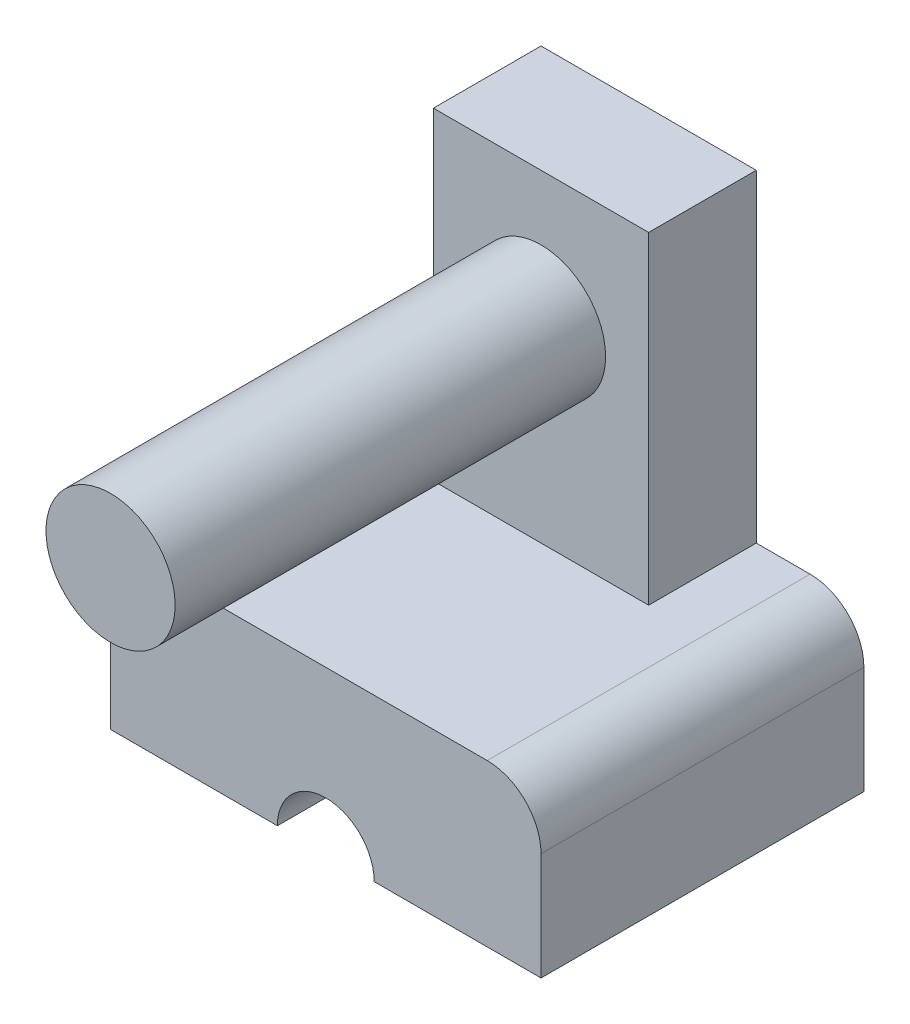
ISO-10303-21;
HEADER;
FILE_DESCRIPTION(('STEP AP214'),'2;1');
FILE_NAME('part.step','',(''),(''),'','','');
FILE_SCHEMA(('AUTOMOTIVE_DESIGN { 1 0 10303 214 1 1 1 1 }'));
ENDSEC;
DATA;
#1=APPLICATION_CONTEXT('core data for automotive mechanical design processes');
#2=APPLICATION_PROTOCOL_DEFINITION('international standard','automotive_design',2000,#1);
#3=PRODUCT_CONTEXT('',#1,'mechanical');
#4=PRODUCT('Part','Part','',(#3));
#5=PRODUCT_RELATED_PRODUCT_CATEGORY('part','',(#4));
#6=PRODUCT_DEFINITION_FORMATION('','',#4);
#7=PRODUCT_DEFINITION_CONTEXT('part definition',#1,'design');
#8=PRODUCT_DEFINITION('design','',#6,#7);
#9=PRODUCT_DEFINITION_SHAPE('','',#8);
#10=(LENGTH_UNIT() NAMED_UNIT(*) SI_UNIT(.MILLI.,.METRE.));
#11=(NAMED_UNIT(*) PLANE_ANGLE_UNIT() SI_UNIT($,.RADIAN.));
#12=(NAMED_UNIT(*) SI_UNIT($,.STERADIAN.) SOLID_ANGLE_UNIT());
#13=UNCERTAINTY_MEASURE_WITH_UNIT(LENGTH_MEASURE(1.E-05),#10,'distance_accuracy_value','');
#14=(GEOMETRIC_REPRESENTATION_CONTEXT(3) GLOBAL_UNCERTAINTY_ASSIGNED_CONTEXT((#13)) GLOBAL_UNIT_ASSIGNED_CONTEXT((#10,
#11,#12)) REPRESENTATION_CONTEXT('',''));
#15=CARTESIAN_POINT('',(0.,0.,0.));
#16=DIRECTION('',(0.,0.,1.));
#17=DIRECTION('',(1.,0.,0.));
#18=AXIS2_PLACEMENT_3D('',#15,#16,#17);
#19=CARTESIAN_POINT('',(0.,0.,0.));
#20=DIRECTION('',(0.,0.,1.));
#21=DIRECTION('',(1.,0.,0.));
#22=AXIS2_PLACEMENT_3D('',#19,#20,#21);
#23=PLANE('',#22);
#24=CARTESIAN_POINT('',(-25.,-5.,0.));
#25=DIRECTION('',(0.,0.,-1.));
#26=DIRECTION('',(-1.,0.,0.));
#27=AXIS2_PLACEMENT_3D('',#24,#25,#26);
#28=CIRCLE('',#27,5.);
#29=CARTESIAN_POINT('',(-30.,-5.00000000000003,0.));
#30=VERTEX_POINT('',#29);
#31=CARTESIAN_POINT('',(-25.,0.,0.));
#32=VERTEX_POINT('',#31);
#33=EDGE_CURVE('E123',#30,#32,#28,.T.);
#34=ORIENTED_EDGE('',*,*,#33,.T.);
#35=DIRECTION('',(1.,0.,0.));
#36=VECTOR('',#35,1.);
#37=CARTESIAN_POINT('',(10.,0.,0.));
#38=LINE('',#37,#36);
#39=CARTESIAN_POINT('',(-20.,0.,0.));
#40=VERTEX_POINT('',#39);
#41=EDGE_CURVE('E210',#32,#40,#38,.T.);
#42=ORIENTED_EDGE('',*,*,#41,.T.);
#43=DIRECTION('',(0.,-1.,0.));
#44=VECTOR('',#43,1.);
#45=CARTESIAN_POINT('',(-20.,0.,0.));
#46=LINE('',#45,#44);
#47=CARTESIAN_POINT('',(-20.,30.,0.));
#48=VERTEX_POINT('',#47);
#49=EDGE_CURVE('E169',#48,#40,#46,.T.);
#50=ORIENTED_EDGE('',*,*,#49,.F.);
#51=DIRECTION('',(-1.,0.,0.));
#52=VECTOR('',#51,1.);
#53=CARTESIAN_POINT('',(0.,30.,0.));
#54=LINE('',#53,#52);
#55=CARTESIAN_POINT('',(0.,30.,0.));
#56=VERTEX_POINT('',#55);
#57=EDGE_CURVE('E178',#56,#48,#54,.T.);
#58=ORIENTED_EDGE('',*,*,#57,.F.);
#59=DIRECTION('',(0.,1.,0.));
#60=VECTOR('',#59,1.);
#61=CARTESIAN_POINT('',(0.,0.,0.));
#62=LINE('',#61,#60);
#63=CARTESIAN_POINT('',(0.,0.,0.));
#64=VERTEX_POINT('',#63);
#65=EDGE_CURVE('E159',#64,#56,#62,.T.);
#66=ORIENTED_EDGE('',*,*,#65,.F.);
#67=CARTESIAN_POINT('',(4.99999999999996,0.,0.));
#68=VERTEX_POINT('',#67);
#69=EDGE_CURVE('E207',#64,#68,#38,.T.);
#70=ORIENTED_EDGE('',*,*,#69,.T.);
#71=CARTESIAN_POINT('',(5.,-5.,0.));
#72=DIRECTION('',(0.,0.,-1.));
#73=DIRECTION('',(-1.,0.,0.));
#74=AXIS2_PLACEMENT_3D('',#71,#72,#73);
#75=CIRCLE('',#74,5.);
#76=CARTESIAN_POINT('',(10.,-5.00000000000003,0.));
#77=VERTEX_POINT('',#76);
#78=EDGE_CURVE('E52',#77,#68,#75,.F.);
#79=ORIENTED_EDGE('',*,*,#78,.F.);
#80=DIRECTION('',(0.,1.,0.));
#81=VECTOR('',#80,1.);
#82=CARTESIAN_POINT('',(10.,-15.,0.));
#83=LINE('',#82,#81);
#84=CARTESIAN_POINT('',(10.,-15.,0.));
#85=VERTEX_POINT('',#84);
#86=EDGE_CURVE('E146',#85,#77,#83,.T.);
#87=ORIENTED_EDGE('',*,*,#86,.F.);
#88=DIRECTION('',(1.,0.,0.));
#89=VECTOR('',#88,1.);
#90=CARTESIAN_POINT('',(10.,-15.,0.));
#91=LINE('',#90,#89);
#92=CARTESIAN_POINT('',(-5.5,-15.,0.));
#93=VERTEX_POINT('',#92);
#94=EDGE_CURVE('E228',#93,#85,#91,.T.);
#95=ORIENTED_EDGE('',*,*,#94,.F.);
#96=CARTESIAN_POINT('',(-10.,-15.,0.));
#97=DIRECTION('',(0.,0.,-1.));
#98=DIRECTION('',(-1.,0.,0.));
#99=AXIS2_PLACEMENT_3D('',#96,#97,#98);
#100=CIRCLE('',#99,4.5);
#101=CARTESIAN_POINT('',(-14.5,-15.,0.));
#102=VERTEX_POINT('',#101);
#103=EDGE_CURVE('E212',#102,#93,#100,.T.);
#104=ORIENTED_EDGE('',*,*,#103,.F.);
#105=CARTESIAN_POINT('',(-30.,-15.,0.));
#106=VERTEX_POINT('',#105);
#107=EDGE_CURVE('E145',#106,#102,#91,.T.);
#108=ORIENTED_EDGE('',*,*,#107,.F.);
#109=DIRECTION('',(0.,1.,0.));
#110=VECTOR('',#109,1.);
#111=CARTESIAN_POINT('',(-30.,-15.,0.));
#112=LINE('',#111,#110);
#113=EDGE_CURVE('E137',#106,#30,#112,.T.);
#114=ORIENTED_EDGE('',*,*,#113,.T.);
#115=EDGE_LOOP('',(#34,#42,#50,#58,#66,#70,#79,#87,#95,#104,#108,#114));
#116=FACE_BOUND('',#115,.T.);
#117=ADVANCED_FACE('F37',(#116),#23,.F.);
#118=CARTESIAN_POINT('',(10.,-15.,30.));
#119=DIRECTION('',(0.,0.,-1.));
#120=DIRECTION('',(-1.,0.,0.));
#121=AXIS2_PLACEMENT_3D('',#118,#119,#120);
#122=PLANE('',#121);
#123=CARTESIAN_POINT('',(-25.,-5.,30.));
#124=DIRECTION('',(0.,0.,-1.));
#125=DIRECTION('',(-1.,0.,0.));
#126=AXIS2_PLACEMENT_3D('',#123,#124,#125);
#127=CIRCLE('',#126,5.);
#128=CARTESIAN_POINT('',(-30.,-5.00000000000003,30.));
#129=VERTEX_POINT('',#128);
#130=CARTESIAN_POINT('',(-25.,0.,30.));
#131=VERTEX_POINT('',#130);
#132=EDGE_CURVE('E59',#129,#131,#127,.T.);
#133=ORIENTED_EDGE('',*,*,#132,.F.);
#134=DIRECTION('',(0.,1.,0.));
#135=VECTOR('',#134,1.);
#136=CARTESIAN_POINT('',(-30.,-15.,30.));
#137=LINE('',#136,#135);
#138=CARTESIAN_POINT('',(-30.,-15.,30.));
#139=VERTEX_POINT('',#138);
#140=EDGE_CURVE('E140',#139,#129,#137,.T.);
#141=ORIENTED_EDGE('',*,*,#140,.F.);
#142=DIRECTION('',(-1.,0.,0.));
#143=VECTOR('',#142,1.);
#144=CARTESIAN_POINT('',(10.,-15.,30.));
#145=LINE('',#144,#143);
#146=CARTESIAN_POINT('',(-14.5,-15.,30.));
#147=VERTEX_POINT('',#146);
#148=EDGE_CURVE('E219',#147,#139,#145,.T.);
#149=ORIENTED_EDGE('',*,*,#148,.F.);
#150=CARTESIAN_POINT('',(-10.,-15.,30.));
#151=DIRECTION('',(0.,0.,-1.));
#152=DIRECTION('',(-1.,0.,0.));
#153=AXIS2_PLACEMENT_3D('',#150,#151,#152);
#154=CIRCLE('',#153,4.5);
#155=CARTESIAN_POINT('',(-5.5,-15.,30.));
#156=VERTEX_POINT('',#155);
#157=EDGE_CURVE('E208',#147,#156,#154,.T.);
#158=ORIENTED_EDGE('',*,*,#157,.T.);
#159=CARTESIAN_POINT('',(10.,-15.,30.));
#160=VERTEX_POINT('',#159);
#161=EDGE_CURVE('E224',#160,#156,#145,.T.);
#162=ORIENTED_EDGE('',*,*,#161,.F.);
#163=DIRECTION('',(0.,1.,0.));
#164=VECTOR('',#163,1.);
#165=CARTESIAN_POINT('',(10.,-15.,30.));
#166=LINE('',#165,#164);
#167=CARTESIAN_POINT('',(10.,-5.00000000000003,30.));
#168=VERTEX_POINT('',#167);
#169=EDGE_CURVE('E148',#160,#168,#166,.T.);
#170=ORIENTED_EDGE('',*,*,#169,.T.);
#171=CARTESIAN_POINT('',(5.,-5.,30.));
#172=DIRECTION('',(0.,0.,-1.));
#173=DIRECTION('',(-1.,0.,0.));
#174=AXIS2_PLACEMENT_3D('',#171,#172,#173);
#175=CIRCLE('',#174,5.);
#176=CARTESIAN_POINT('',(4.99999999999996,0.,30.));
#177=VERTEX_POINT('',#176);
#178=EDGE_CURVE('E141',#168,#177,#175,.F.);
#179=ORIENTED_EDGE('',*,*,#178,.T.);
#180=DIRECTION('',(-1.,0.,0.));
#181=VECTOR('',#180,1.);
#182=CARTESIAN_POINT('',(10.,0.,30.));
#183=LINE('',#182,#181);
#184=EDGE_CURVE('E203',#177,#131,#183,.T.);
#185=ORIENTED_EDGE('',*,*,#184,.T.);
#186=EDGE_LOOP('',(#133,#141,#149,#158,#162,#170,#179,#185));
#187=FACE_BOUND('',#186,.T.);
#188=ADVANCED_FACE('F202',(#187),#122,.F.);
#189=CARTESIAN_POINT('',(0.,0.,0.));
#190=DIRECTION('',(0.,-1.,0.));
#191=DIRECTION('',(0.,0.,-1.));
#192=AXIS2_PLACEMENT_3D('',#189,#190,#191);
#193=PLANE('',#192);
#194=DIRECTION('',(0.,0.,-1.));
#195=VECTOR('',#194,1.);
#196=CARTESIAN_POINT('',(-25.,0.,55.));
#197=LINE('',#196,#195);
#198=EDGE_CURVE('E12',#131,#32,#197,.T.);
#199=ORIENTED_EDGE('',*,*,#198,.F.);
#200=ORIENTED_EDGE('',*,*,#184,.F.);
#201=DIRECTION('',(0.,0.,-1.));
#202=VECTOR('',#201,1.);
#203=CARTESIAN_POINT('',(5.,0.,55.));
#204=LINE('',#203,#202);
#205=EDGE_CURVE('E45',#68,#177,#204,.F.);
#206=ORIENTED_EDGE('',*,*,#205,.F.);
#207=ORIENTED_EDGE('',*,*,#69,.F.);
#208=DIRECTION('',(0.,0.,-1.));
#209=VECTOR('',#208,1.);
#210=CARTESIAN_POINT('',(0.,0.,10.));
#211=LINE('',#210,#209);
#212=CARTESIAN_POINT('',(0.,0.,10.));
#213=VERTEX_POINT('',#212);
#214=EDGE_CURVE('E175',#213,#64,#211,.T.);
#215=ORIENTED_EDGE('',*,*,#214,.F.);
#216=DIRECTION('',(1.,0.,0.));
#217=VECTOR('',#216,1.);
#218=CARTESIAN_POINT('',(0.,0.,10.));
#219=LINE('',#218,#217);
#220=CARTESIAN_POINT('',(-20.,0.,10.));
#221=VERTEX_POINT('',#220);
#222=EDGE_CURVE('E173',#221,#213,#219,.T.);
#223=ORIENTED_EDGE('',*,*,#222,.F.);
#224=DIRECTION('',(0.,0.,-1.));
#225=VECTOR('',#224,1.);
#226=CARTESIAN_POINT('',(-20.,0.,10.));
#227=LINE('',#226,#225);
#228=EDGE_CURVE('E183',#221,#40,#227,.T.);
#229=ORIENTED_EDGE('',*,*,#228,.T.);
#230=ORIENTED_EDGE('',*,*,#41,.F.);
#231=EDGE_LOOP('',(#199,#200,#206,#207,#215,#223,#229,#230));
#232=FACE_BOUND('',#231,.T.);
#233=ADVANCED_FACE('F206',(#232),#193,.F.);
#234=CARTESIAN_POINT('',(0.,-15.,0.));
#235=DIRECTION('',(0.,-1.,0.));
#236=DIRECTION('',(0.,0.,-1.));
#237=AXIS2_PLACEMENT_3D('',#234,#235,#236);
#238=PLANE('',#237);
#239=DIRECTION('',(0.,0.,-1.));
#240=VECTOR('',#239,1.);
#241=CARTESIAN_POINT('',(-14.5,-15.,55.));
#242=LINE('',#241,#240);
#243=EDGE_CURVE('E192',#147,#102,#242,.T.);
#244=ORIENTED_EDGE('',*,*,#243,.F.);
#245=ORIENTED_EDGE('',*,*,#148,.T.);
#246=DIRECTION('',(0.,0.,-1.));
#247=VECTOR('',#246,1.);
#248=CARTESIAN_POINT('',(-30.,-15.,0.));
#249=LINE('',#248,#247);
#250=EDGE_CURVE('E227',#139,#106,#249,.T.);
#251=ORIENTED_EDGE('',*,*,#250,.T.);
#252=ORIENTED_EDGE('',*,*,#107,.T.);
#253=EDGE_LOOP('',(#244,#245,#251,#252));
#254=FACE_BOUND('',#253,.T.);
#255=ADVANCED_FACE('F234',(#254),#238,.T.);
#256=CARTESIAN_POINT('',(0.,0.,10.));
#257=DIRECTION('',(-1.,0.,0.));
#258=DIRECTION('',(0.,-1.,0.));
#259=AXIS2_PLACEMENT_3D('',#256,#257,#258);
#260=PLANE('',#259);
#261=ORIENTED_EDGE('',*,*,#65,.T.);
#262=DIRECTION('',(0.,0.,-1.));
#263=VECTOR('',#262,1.);
#264=CARTESIAN_POINT('',(0.,30.,10.));
#265=LINE('',#264,#263);
#266=CARTESIAN_POINT('',(0.,30.,10.));
#267=VERTEX_POINT('',#266);
#268=EDGE_CURVE('E164',#267,#56,#265,.T.);
#269=ORIENTED_EDGE('',*,*,#268,.F.);
#270=DIRECTION('',(0.,1.,0.));
#271=VECTOR('',#270,1.);
#272=CARTESIAN_POINT('',(0.,0.,10.));
#273=LINE('',#272,#271);
#274=EDGE_CURVE('E165',#213,#267,#273,.T.);
#275=ORIENTED_EDGE('',*,*,#274,.F.);
#276=ORIENTED_EDGE('',*,*,#214,.T.);
#277=EDGE_LOOP('',(#261,#269,#275,#276));
#278=FACE_BOUND('',#277,.T.);
#279=ADVANCED_FACE('F39',(#278),#260,.F.);
#280=CARTESIAN_POINT('',(0.,30.,10.));
#281=DIRECTION('',(0.,-1.,0.));
#282=DIRECTION('',(1.,0.,0.));
#283=AXIS2_PLACEMENT_3D('',#280,#281,#282);
#284=PLANE('',#283);
#285=ORIENTED_EDGE('',*,*,#57,.T.);
#286=DIRECTION('',(0.,0.,-1.));
#287=VECTOR('',#286,1.);
#288=CARTESIAN_POINT('',(-20.,30.,10.));
#289=LINE('',#288,#287);
#290=CARTESIAN_POINT('',(-20.,30.,10.));
#291=VERTEX_POINT('',#290);
#292=EDGE_CURVE('E186',#291,#48,#289,.T.);
#293=ORIENTED_EDGE('',*,*,#292,.F.);
#294=DIRECTION('',(-1.,0.,0.));
#295=VECTOR('',#294,1.);
#296=CARTESIAN_POINT('',(0.,30.,10.));
#297=LINE('',#296,#295);
#298=EDGE_CURVE('E168',#267,#291,#297,.T.);
#299=ORIENTED_EDGE('',*,*,#298,.F.);
#300=ORIENTED_EDGE('',*,*,#268,.T.);
#301=EDGE_LOOP('',(#285,#293,#299,#300));
#302=FACE_BOUND('',#301,.T.);
#303=ADVANCED_FACE('F267',(#302),#284,.F.);
#304=CARTESIAN_POINT('',(-20.,0.,10.));
#305=DIRECTION('',(1.,0.,0.));
#306=DIRECTION('',(0.,0.,-1.));
#307=AXIS2_PLACEMENT_3D('',#304,#305,#306);
#308=PLANE('',#307);
#309=ORIENTED_EDGE('',*,*,#49,.T.);
#310=ORIENTED_EDGE('',*,*,#228,.F.);
#311=DIRECTION('',(0.,-1.,0.));
#312=VECTOR('',#311,1.);
#313=CARTESIAN_POINT('',(-20.,0.,10.));
#314=LINE('',#313,#312);
#315=EDGE_CURVE('E171',#291,#221,#314,.T.);
#316=ORIENTED_EDGE('',*,*,#315,.F.);
#317=ORIENTED_EDGE('',*,*,#292,.T.);
#318=EDGE_LOOP('',(#309,#310,#316,#317));
#319=FACE_BOUND('',#318,.T.);
#320=ADVANCED_FACE('F265',(#319),#308,.F.);
#321=CARTESIAN_POINT('',(0.,0.,10.));
#322=DIRECTION('',(0.,0.,1.));
#323=DIRECTION('',(1.,0.,0.));
#324=AXIS2_PLACEMENT_3D('',#321,#322,#323);
#325=PLANE('',#324);
#326=CARTESIAN_POINT('',(-10.,18.,10.));
#327=DIRECTION('',(0.,0.,1.));
#328=DIRECTION('',(1.,0.,0.));
#329=AXIS2_PLACEMENT_3D('',#326,#327,#328);
#330=CIRCLE('',#329,6.);
#331=CARTESIAN_POINT('',(-4.,18.,10.));
#332=VERTEX_POINT('',#331);
#333=EDGE_CURVE('E160',#332,#332,#330,.T.);
#334=ORIENTED_EDGE('',*,*,#333,.F.);
#335=EDGE_LOOP('',(#334));
#336=FACE_BOUND('',#335,.T.);
#337=ORIENTED_EDGE('',*,*,#274,.T.);
#338=ORIENTED_EDGE('',*,*,#298,.T.);
#339=ORIENTED_EDGE('',*,*,#315,.T.);
#340=ORIENTED_EDGE('',*,*,#222,.T.);
#341=EDGE_LOOP('',(#337,#338,#339,#340));
#342=FACE_BOUND('',#341,.T.);
#343=ADVANCED_FACE('F263',(#336,#342),#325,.T.);
#344=CARTESIAN_POINT('',(-10.,18.,50.));
#345=DIRECTION('',(0.,0.,-1.));
#346=DIRECTION('',(-1.,0.,0.));
#347=AXIS2_PLACEMENT_3D('',#344,#345,#346);
#348=CYLINDRICAL_SURFACE('',#347,6.);
#349=CARTESIAN_POINT('',(-10.,18.,50.));
#350=DIRECTION('',(0.,0.,1.));
#351=DIRECTION('',(1.,0.,0.));
#352=AXIS2_PLACEMENT_3D('',#349,#350,#351);
#353=CIRCLE('',#352,6.);
#354=CARTESIAN_POINT('',(-4.,18.,50.));
#355=VERTEX_POINT('',#354);
#356=EDGE_CURVE('E156',#355,#355,#353,.T.);
#357=ORIENTED_EDGE('',*,*,#356,.F.);
#358=EDGE_LOOP('',(#357));
#359=FACE_BOUND('',#358,.T.);
#360=ORIENTED_EDGE('',*,*,#333,.T.);
#361=EDGE_LOOP('',(#360));
#362=FACE_BOUND('',#361,.T.);
#363=ADVANCED_FACE('F252',(#359,#362),#348,.T.);
#364=CARTESIAN_POINT('',(-10.,18.,50.));
#365=DIRECTION('',(0.,0.,1.));
#366=DIRECTION('',(1.,0.,0.));
#367=AXIS2_PLACEMENT_3D('',#364,#365,#366);
#368=PLANE('',#367);
#369=ORIENTED_EDGE('',*,*,#356,.T.);
#370=EDGE_LOOP('',(#369));
#371=FACE_BOUND('',#370,.T.);
#372=ADVANCED_FACE('F244',(#371),#368,.T.);
#373=CARTESIAN_POINT('',(10.,-15.,0.));
#374=DIRECTION('',(-1.,0.,0.));
#375=DIRECTION('',(0.,0.,1.));
#376=AXIS2_PLACEMENT_3D('',#373,#374,#375);
#377=PLANE('',#376);
#378=ORIENTED_EDGE('',*,*,#86,.T.);
#379=DIRECTION('',(0.,0.,-1.));
#380=VECTOR('',#379,1.);
#381=CARTESIAN_POINT('',(10.,-5.00000000000003,55.));
#382=LINE('',#381,#380);
#383=EDGE_CURVE('E130',#168,#77,#382,.T.);
#384=ORIENTED_EDGE('',*,*,#383,.F.);
#385=ORIENTED_EDGE('',*,*,#169,.F.);
#386=DIRECTION('',(0.,0.,1.));
#387=VECTOR('',#386,1.);
#388=CARTESIAN_POINT('',(10.,-15.,0.));
#389=LINE('',#388,#387);
#390=EDGE_CURVE('E216',#85,#160,#389,.T.);
#391=ORIENTED_EDGE('',*,*,#390,.F.);
#392=EDGE_LOOP('',(#378,#384,#385,#391));
#393=FACE_BOUND('',#392,.T.);
#394=ADVANCED_FACE('F242',(#393),#377,.F.);
#395=CARTESIAN_POINT('',(-30.,-15.,0.));
#396=DIRECTION('',(1.,0.,0.));
#397=DIRECTION('',(0.,0.,-1.));
#398=AXIS2_PLACEMENT_3D('',#395,#396,#397);
#399=PLANE('',#398);
#400=ORIENTED_EDGE('',*,*,#140,.T.);
#401=DIRECTION('',(0.,0.,-1.));
#402=VECTOR('',#401,1.);
#403=CARTESIAN_POINT('',(-30.,-5.00000000000003,55.));
#404=LINE('',#403,#402);
#405=EDGE_CURVE('E126',#129,#30,#404,.T.);
#406=ORIENTED_EDGE('',*,*,#405,.T.);
#407=ORIENTED_EDGE('',*,*,#113,.F.);
#408=ORIENTED_EDGE('',*,*,#250,.F.);
#409=EDGE_LOOP('',(#400,#406,#407,#408));
#410=FACE_BOUND('',#409,.T.);
#411=ADVANCED_FACE('F135',(#410),#399,.F.);
#412=DIRECTION('',(0.,0.,-1.));
#413=VECTOR('',#412,1.);
#414=CARTESIAN_POINT('',(-5.5,-15.,55.));
#415=LINE('',#414,#413);
#416=EDGE_CURVE('E163',#93,#156,#415,.F.);
#417=ORIENTED_EDGE('',*,*,#416,.F.);
#418=ORIENTED_EDGE('',*,*,#94,.T.);
#419=ORIENTED_EDGE('',*,*,#390,.T.);
#420=ORIENTED_EDGE('',*,*,#161,.T.);
#421=EDGE_LOOP('',(#417,#418,#419,#420));
#422=FACE_BOUND('',#421,.T.);
#423=ADVANCED_FACE('F250',(#422),#238,.T.);
#424=CARTESIAN_POINT('',(-10.,-15.,55.));
#425=DIRECTION('',(0.,0.,-1.));
#426=DIRECTION('',(-1.,0.,0.));
#427=AXIS2_PLACEMENT_3D('',#424,#425,#426);
#428=CYLINDRICAL_SURFACE('',#427,4.5);
#429=ORIENTED_EDGE('',*,*,#243,.T.);
#430=ORIENTED_EDGE('',*,*,#103,.T.);
#431=ORIENTED_EDGE('',*,*,#416,.T.);
#432=ORIENTED_EDGE('',*,*,#157,.F.);
#433=EDGE_LOOP('',(#429,#430,#431,#432));
#434=FACE_BOUND('',#433,.T.);
#435=ADVANCED_FACE('F335',(#434),#428,.F.);
#436=CARTESIAN_POINT('',(5.,-5.,55.));
#437=DIRECTION('',(0.,0.,-1.));
#438=DIRECTION('',(-1.,0.,0.));
#439=AXIS2_PLACEMENT_3D('',#436,#437,#438);
#440=CYLINDRICAL_SURFACE('',#439,5.);
#441=ORIENTED_EDGE('',*,*,#383,.T.);
#442=ORIENTED_EDGE('',*,*,#78,.T.);
#443=ORIENTED_EDGE('',*,*,#205,.T.);
#444=ORIENTED_EDGE('',*,*,#178,.F.);
#445=EDGE_LOOP('',(#441,#442,#443,#444));
#446=FACE_BOUND('',#445,.T.);
#447=ADVANCED_FACE('F194',(#446),#440,.T.);
#448=CARTESIAN_POINT('',(-25.,-5.,55.));
#449=DIRECTION('',(0.,0.,-1.));
#450=DIRECTION('',(-1.,0.,0.));
#451=AXIS2_PLACEMENT_3D('',#448,#449,#450);
#452=CYLINDRICAL_SURFACE('',#451,5.);
#453=ORIENTED_EDGE('',*,*,#132,.T.);
#454=ORIENTED_EDGE('',*,*,#198,.T.);
#455=ORIENTED_EDGE('',*,*,#33,.F.);
#456=ORIENTED_EDGE('',*,*,#405,.F.);
#457=EDGE_LOOP('',(#453,#454,#455,#456));
#458=FACE_BOUND('',#457,.T.);
#459=ADVANCED_FACE('F125',(#458),#452,.T.);
#460=CLOSED_SHELL('',(#117,#188,#233,#255,#279,#303,#320,#343,#363,#372,#394,#411,#423,#435,
#447,#459));
#461=MANIFOLD_SOLID_BREP('B2',#460);
#462=ADVANCED_BREP_SHAPE_REPRESENTATION('',(#18,#461),#14);
#463=SHAPE_DEFINITION_REPRESENTATION(#9,#462);
ENDSEC;
END-ISO-10303-21;
